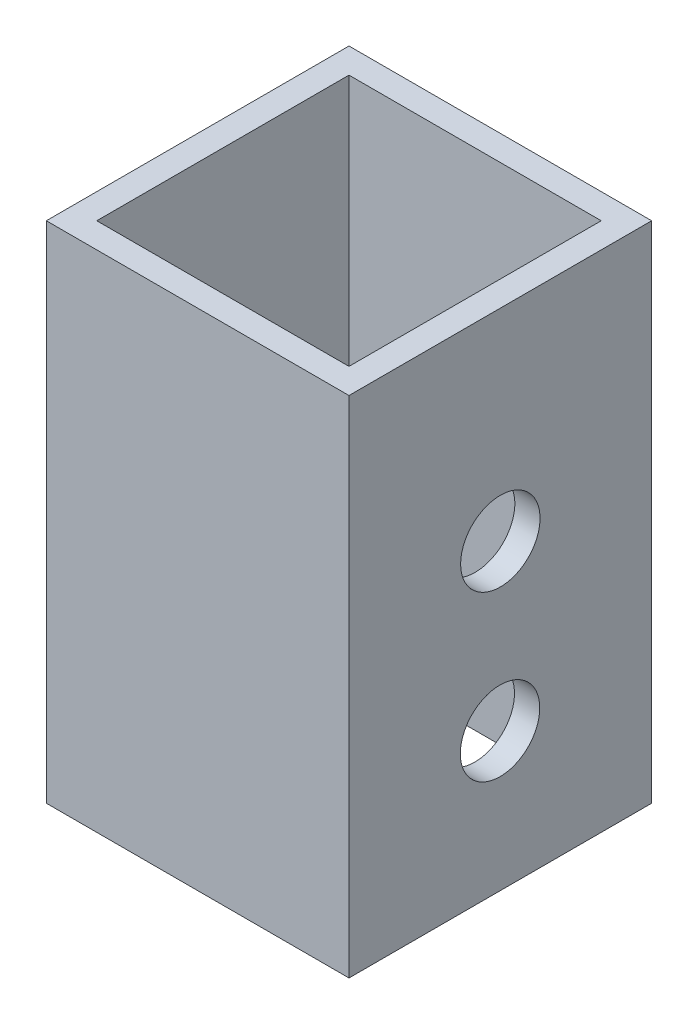
ISO-10303-21;
HEADER;
FILE_DESCRIPTION(('STEP AP214'),'2;1');
FILE_NAME('part.step','',(''),(''),'','','');
FILE_SCHEMA(('AUTOMOTIVE_DESIGN { 1 0 10303 214 1 1 1 1 }'));
ENDSEC;
DATA;
#1=APPLICATION_CONTEXT('core data for automotive mechanical design processes');
#2=APPLICATION_PROTOCOL_DEFINITION('international standard','automotive_design',2000,#1);
#3=PRODUCT_CONTEXT('',#1,'mechanical');
#4=PRODUCT('Part','Part','',(#3));
#5=PRODUCT_RELATED_PRODUCT_CATEGORY('part','',(#4));
#6=PRODUCT_DEFINITION_FORMATION('','',#4);
#7=PRODUCT_DEFINITION_CONTEXT('part definition',#1,'design');
#8=PRODUCT_DEFINITION('design','',#6,#7);
#9=PRODUCT_DEFINITION_SHAPE('','',#8);
#10=(LENGTH_UNIT() NAMED_UNIT(*) SI_UNIT(.MILLI.,.METRE.));
#11=(NAMED_UNIT(*) PLANE_ANGLE_UNIT() SI_UNIT($,.RADIAN.));
#12=(NAMED_UNIT(*) SI_UNIT($,.STERADIAN.) SOLID_ANGLE_UNIT());
#13=UNCERTAINTY_MEASURE_WITH_UNIT(LENGTH_MEASURE(1.E-05),#10,'distance_accuracy_value','');
#14=(GEOMETRIC_REPRESENTATION_CONTEXT(3) GLOBAL_UNCERTAINTY_ASSIGNED_CONTEXT((#13)) GLOBAL_UNIT_ASSIGNED_CONTEXT((#10,
#11,#12)) REPRESENTATION_CONTEXT('',''));
#15=CARTESIAN_POINT('',(0.,0.,0.));
#16=DIRECTION('',(0.,0.,1.));
#17=DIRECTION('',(1.,0.,0.));
#18=AXIS2_PLACEMENT_3D('',#15,#16,#17);
#19=CARTESIAN_POINT('',(0.,127.,0.));
#20=DIRECTION('',(0.,-1.,0.));
#21=DIRECTION('',(0.,0.,-1.));
#22=AXIS2_PLACEMENT_3D('',#19,#20,#21);
#23=PLANE('',#22);
#24=DIRECTION('',(0.,0.,-1.));
#25=VECTOR('',#24,1.);
#26=CARTESIAN_POINT('',(38.1,127.,38.1));
#27=LINE('',#26,#25);
#28=CARTESIAN_POINT('',(38.1,127.,38.1));
#29=VERTEX_POINT('',#28);
#30=CARTESIAN_POINT('',(38.1,127.,-38.1));
#31=VERTEX_POINT('',#30);
#32=EDGE_CURVE('E138',#29,#31,#27,.T.);
#33=ORIENTED_EDGE('',*,*,#32,.T.);
#34=DIRECTION('',(-1.,0.,0.));
#35=VECTOR('',#34,1.);
#36=CARTESIAN_POINT('',(-38.1,127.,-38.1));
#37=LINE('',#36,#35);
#38=CARTESIAN_POINT('',(-38.1,127.,-38.1));
#39=VERTEX_POINT('',#38);
#40=EDGE_CURVE('E141',#31,#39,#37,.T.);
#41=ORIENTED_EDGE('',*,*,#40,.T.);
#42=DIRECTION('',(0.,0.,1.));
#43=VECTOR('',#42,1.);
#44=CARTESIAN_POINT('',(-38.1,127.,38.1));
#45=LINE('',#44,#43);
#46=CARTESIAN_POINT('',(-38.1,127.,38.1));
#47=VERTEX_POINT('',#46);
#48=EDGE_CURVE('E144',#39,#47,#45,.T.);
#49=ORIENTED_EDGE('',*,*,#48,.T.);
#50=DIRECTION('',(1.,0.,0.));
#51=VECTOR('',#50,1.);
#52=CARTESIAN_POINT('',(-38.1,127.,38.1));
#53=LINE('',#52,#51);
#54=EDGE_CURVE('E146',#47,#29,#53,.T.);
#55=ORIENTED_EDGE('',*,*,#54,.T.);
#56=EDGE_LOOP('',(#33,#41,#49,#55));
#57=FACE_BOUND('',#56,.T.);
#58=DIRECTION('',(0.,0.,-1.));
#59=VECTOR('',#58,1.);
#60=CARTESIAN_POINT('',(31.75,127.,31.75));
#61=LINE('',#60,#59);
#62=CARTESIAN_POINT('',(31.75,127.,31.75));
#63=VERTEX_POINT('',#62);
#64=CARTESIAN_POINT('',(31.75,127.,-31.75));
#65=VERTEX_POINT('',#64);
#66=EDGE_CURVE('E100',#63,#65,#61,.T.);
#67=ORIENTED_EDGE('',*,*,#66,.F.);
#68=DIRECTION('',(1.,0.,0.));
#69=VECTOR('',#68,1.);
#70=CARTESIAN_POINT('',(-31.75,127.,31.75));
#71=LINE('',#70,#69);
#72=CARTESIAN_POINT('',(-31.75,127.,31.75));
#73=VERTEX_POINT('',#72);
#74=EDGE_CURVE('E122',#73,#63,#71,.T.);
#75=ORIENTED_EDGE('',*,*,#74,.F.);
#76=DIRECTION('',(0.,0.,1.));
#77=VECTOR('',#76,1.);
#78=CARTESIAN_POINT('',(-31.75,127.,31.75));
#79=LINE('',#78,#77);
#80=CARTESIAN_POINT('',(-31.75,127.,-31.75));
#81=VERTEX_POINT('',#80);
#82=EDGE_CURVE('E120',#81,#73,#79,.T.);
#83=ORIENTED_EDGE('',*,*,#82,.F.);
#84=DIRECTION('',(-1.,0.,0.));
#85=VECTOR('',#84,1.);
#86=CARTESIAN_POINT('',(-31.75,127.,-31.75));
#87=LINE('',#86,#85);
#88=EDGE_CURVE('E108',#65,#81,#87,.T.);
#89=ORIENTED_EDGE('',*,*,#88,.F.);
#90=EDGE_LOOP('',(#67,#75,#83,#89));
#91=FACE_BOUND('',#90,.T.);
#92=ADVANCED_FACE('F33',(#57,#91),#23,.F.);
#93=CARTESIAN_POINT('',(0.,0.,0.));
#94=DIRECTION('',(0.,-1.,0.));
#95=DIRECTION('',(0.,0.,-1.));
#96=AXIS2_PLACEMENT_3D('',#93,#94,#95);
#97=PLANE('',#96);
#98=DIRECTION('',(0.,0.,-1.));
#99=VECTOR('',#98,1.);
#100=CARTESIAN_POINT('',(38.1,0.,38.1));
#101=LINE('',#100,#99);
#102=CARTESIAN_POINT('',(38.1,0.,38.1));
#103=VERTEX_POINT('',#102);
#104=CARTESIAN_POINT('',(38.1,0.,-38.1));
#105=VERTEX_POINT('',#104);
#106=EDGE_CURVE('E116',#103,#105,#101,.T.);
#107=ORIENTED_EDGE('',*,*,#106,.F.);
#108=DIRECTION('',(1.,0.,0.));
#109=VECTOR('',#108,1.);
#110=CARTESIAN_POINT('',(-38.1,0.,38.1));
#111=LINE('',#110,#109);
#112=CARTESIAN_POINT('',(-38.1,0.,38.1));
#113=VERTEX_POINT('',#112);
#114=EDGE_CURVE('E142',#113,#103,#111,.T.);
#115=ORIENTED_EDGE('',*,*,#114,.F.);
#116=DIRECTION('',(0.,0.,1.));
#117=VECTOR('',#116,1.);
#118=CARTESIAN_POINT('',(-38.1,0.,38.1));
#119=LINE('',#118,#117);
#120=CARTESIAN_POINT('',(-38.1,0.,-38.1));
#121=VERTEX_POINT('',#120);
#122=EDGE_CURVE('E153',#121,#113,#119,.T.);
#123=ORIENTED_EDGE('',*,*,#122,.F.);
#124=DIRECTION('',(-1.,0.,0.));
#125=VECTOR('',#124,1.);
#126=CARTESIAN_POINT('',(-38.1,0.,-38.1));
#127=LINE('',#126,#125);
#128=EDGE_CURVE('E151',#105,#121,#127,.T.);
#129=ORIENTED_EDGE('',*,*,#128,.F.);
#130=EDGE_LOOP('',(#107,#115,#123,#129));
#131=FACE_BOUND('',#130,.T.);
#132=DIRECTION('',(1.,0.,0.));
#133=VECTOR('',#132,1.);
#134=CARTESIAN_POINT('',(-31.75,0.,31.75));
#135=LINE('',#134,#133);
#136=CARTESIAN_POINT('',(-31.75,0.,31.75));
#137=VERTEX_POINT('',#136);
#138=CARTESIAN_POINT('',(31.75,0.,31.75));
#139=VERTEX_POINT('',#138);
#140=EDGE_CURVE('E109',#137,#139,#135,.T.);
#141=ORIENTED_EDGE('',*,*,#140,.T.);
#142=DIRECTION('',(0.,0.,-1.));
#143=VECTOR('',#142,1.);
#144=CARTESIAN_POINT('',(31.75,0.,31.75));
#145=LINE('',#144,#143);
#146=CARTESIAN_POINT('',(31.75,0.,-31.75));
#147=VERTEX_POINT('',#146);
#148=EDGE_CURVE('E58',#139,#147,#145,.T.);
#149=ORIENTED_EDGE('',*,*,#148,.T.);
#150=DIRECTION('',(-1.,0.,0.));
#151=VECTOR('',#150,1.);
#152=CARTESIAN_POINT('',(-31.75,0.,-31.75));
#153=LINE('',#152,#151);
#154=CARTESIAN_POINT('',(-31.75,0.,-31.75));
#155=VERTEX_POINT('',#154);
#156=EDGE_CURVE('E115',#147,#155,#153,.T.);
#157=ORIENTED_EDGE('',*,*,#156,.T.);
#158=DIRECTION('',(0.,0.,1.));
#159=VECTOR('',#158,1.);
#160=CARTESIAN_POINT('',(-31.75,0.,31.75));
#161=LINE('',#160,#159);
#162=EDGE_CURVE('E130',#155,#137,#161,.T.);
#163=ORIENTED_EDGE('',*,*,#162,.T.);
#164=EDGE_LOOP('',(#141,#149,#157,#163));
#165=FACE_BOUND('',#164,.T.);
#166=ADVANCED_FACE('F232',(#131,#165),#97,.T.);
#167=CARTESIAN_POINT('',(38.1,127.,38.1));
#168=DIRECTION('',(-1.,0.,0.));
#169=DIRECTION('',(0.,0.,1.));
#170=AXIS2_PLACEMENT_3D('',#167,#168,#169);
#171=PLANE('',#170);
#172=CARTESIAN_POINT('',(38.1,76.2,0.));
#173=DIRECTION('',(-1.,0.,0.));
#174=DIRECTION('',(0.,0.,1.));
#175=AXIS2_PLACEMENT_3D('',#172,#173,#174);
#176=CIRCLE('',#175,10.);
#177=CARTESIAN_POINT('',(38.1,76.2,10.));
#178=VERTEX_POINT('',#177);
#179=EDGE_CURVE('E315',#178,#178,#176,.T.);
#180=ORIENTED_EDGE('',*,*,#179,.T.);
#181=EDGE_LOOP('',(#180));
#182=FACE_BOUND('',#181,.T.);
#183=CARTESIAN_POINT('',(38.1,34.8835255460422,0.0801285233119672));
#184=DIRECTION('',(-1.,0.,0.));
#185=DIRECTION('',(0.,0.,1.));
#186=AXIS2_PLACEMENT_3D('',#183,#184,#185);
#187=CIRCLE('',#186,10.);
#188=CARTESIAN_POINT('',(38.1,34.8835255460422,10.080128523312));
#189=VERTEX_POINT('',#188);
#190=EDGE_CURVE('E165',#189,#189,#187,.T.);
#191=ORIENTED_EDGE('',*,*,#190,.T.);
#192=EDGE_LOOP('',(#191));
#193=FACE_BOUND('',#192,.T.);
#194=ORIENTED_EDGE('',*,*,#106,.T.);
#195=DIRECTION('',(0.,-1.,0.));
#196=VECTOR('',#195,1.);
#197=CARTESIAN_POINT('',(38.1,127.,-38.1));
#198=LINE('',#197,#196);
#199=EDGE_CURVE('E11',#31,#105,#198,.T.);
#200=ORIENTED_EDGE('',*,*,#199,.F.);
#201=ORIENTED_EDGE('',*,*,#32,.F.);
#202=DIRECTION('',(0.,-1.,0.));
#203=VECTOR('',#202,1.);
#204=CARTESIAN_POINT('',(38.1,127.,38.1));
#205=LINE('',#204,#203);
#206=EDGE_CURVE('E148',#29,#103,#205,.T.);
#207=ORIENTED_EDGE('',*,*,#206,.T.);
#208=EDGE_LOOP('',(#194,#200,#201,#207));
#209=FACE_BOUND('',#208,.T.);
#210=ADVANCED_FACE('F35',(#182,#193,#209),#171,.F.);
#211=CARTESIAN_POINT('',(-38.1,127.,-38.1));
#212=DIRECTION('',(0.,0.,1.));
#213=DIRECTION('',(1.,0.,0.));
#214=AXIS2_PLACEMENT_3D('',#211,#212,#213);
#215=PLANE('',#214);
#216=ORIENTED_EDGE('',*,*,#128,.T.);
#217=DIRECTION('',(0.,-1.,0.));
#218=VECTOR('',#217,1.);
#219=CARTESIAN_POINT('',(-38.1,127.,-38.1));
#220=LINE('',#219,#218);
#221=EDGE_CURVE('E42',#39,#121,#220,.T.);
#222=ORIENTED_EDGE('',*,*,#221,.F.);
#223=ORIENTED_EDGE('',*,*,#40,.F.);
#224=ORIENTED_EDGE('',*,*,#199,.T.);
#225=EDGE_LOOP('',(#216,#222,#223,#224));
#226=FACE_BOUND('',#225,.T.);
#227=ADVANCED_FACE('F219',(#226),#215,.F.);
#228=CARTESIAN_POINT('',(-38.1,127.,38.1));
#229=DIRECTION('',(1.,0.,0.));
#230=DIRECTION('',(0.,0.,-1.));
#231=AXIS2_PLACEMENT_3D('',#228,#229,#230);
#232=PLANE('',#231);
#233=CARTESIAN_POINT('',(-38.1,76.2,0.));
#234=DIRECTION('',(-1.,0.,0.));
#235=DIRECTION('',(0.,0.,1.));
#236=AXIS2_PLACEMENT_3D('',#233,#234,#235);
#237=CIRCLE('',#236,10.);
#238=CARTESIAN_POINT('',(-38.1,76.2,10.));
#239=VERTEX_POINT('',#238);
#240=EDGE_CURVE('E317',#239,#239,#237,.T.);
#241=ORIENTED_EDGE('',*,*,#240,.F.);
#242=EDGE_LOOP('',(#241));
#243=FACE_BOUND('',#242,.T.);
#244=CARTESIAN_POINT('',(-38.1,34.8835255460422,0.0801285233119672));
#245=DIRECTION('',(-1.,0.,0.));
#246=DIRECTION('',(0.,0.,1.));
#247=AXIS2_PLACEMENT_3D('',#244,#245,#246);
#248=CIRCLE('',#247,10.);
#249=CARTESIAN_POINT('',(-38.1,34.8835255460422,10.080128523312));
#250=VERTEX_POINT('',#249);
#251=EDGE_CURVE('E172',#250,#250,#248,.T.);
#252=ORIENTED_EDGE('',*,*,#251,.F.);
#253=EDGE_LOOP('',(#252));
#254=FACE_BOUND('',#253,.T.);
#255=CARTESIAN_POINT('',(-38.1,58.4566978638487,23.6533008411185));
#256=DIRECTION('',(-1.,0.,0.));
#257=DIRECTION('',(0.,0.,1.));
#258=AXIS2_PLACEMENT_3D('',#255,#256,#257);
#259=CIRCLE('',#258,2.4765);
#260=CARTESIAN_POINT('',(-38.1,58.4566978638487,26.1298008411185));
#261=VERTEX_POINT('',#260);
#262=EDGE_CURVE('E169',#261,#261,#259,.T.);
#263=ORIENTED_EDGE('',*,*,#262,.F.);
#264=EDGE_LOOP('',(#263));
#265=FACE_BOUND('',#264,.T.);
#266=CARTESIAN_POINT('',(-38.1,11.3103532282356,23.6533008411185));
#267=DIRECTION('',(-1.,0.,0.));
#268=DIRECTION('',(0.,0.,1.));
#269=AXIS2_PLACEMENT_3D('',#266,#267,#268);
#270=CIRCLE('',#269,2.4765);
#271=CARTESIAN_POINT('',(-38.1,11.3103532282356,26.1298008411185));
#272=VERTEX_POINT('',#271);
#273=EDGE_CURVE('E192',#272,#272,#270,.T.);
#274=ORIENTED_EDGE('',*,*,#273,.F.);
#275=EDGE_LOOP('',(#274));
#276=FACE_BOUND('',#275,.T.);
#277=CARTESIAN_POINT('',(-38.1,11.3103532282356,-23.4930437944946));
#278=DIRECTION('',(-1.,0.,0.));
#279=DIRECTION('',(0.,0.,1.));
#280=AXIS2_PLACEMENT_3D('',#277,#278,#279);
#281=CIRCLE('',#280,2.4765);
#282=CARTESIAN_POINT('',(-38.1,11.3103532282356,-21.0165437944946));
#283=VERTEX_POINT('',#282);
#284=EDGE_CURVE('E186',#283,#283,#281,.T.);
#285=ORIENTED_EDGE('',*,*,#284,.F.);
#286=EDGE_LOOP('',(#285));
#287=FACE_BOUND('',#286,.T.);
#288=CARTESIAN_POINT('',(-38.1,58.4566978638487,-23.4930437944946));
#289=DIRECTION('',(-1.,0.,0.));
#290=DIRECTION('',(0.,0.,1.));
#291=AXIS2_PLACEMENT_3D('',#288,#289,#290);
#292=CIRCLE('',#291,2.47649999999999);
#293=CARTESIAN_POINT('',(-38.1,58.4566978638487,-21.0165437944946));
#294=VERTEX_POINT('',#293);
#295=EDGE_CURVE('E128',#294,#294,#292,.T.);
#296=ORIENTED_EDGE('',*,*,#295,.F.);
#297=EDGE_LOOP('',(#296));
#298=FACE_BOUND('',#297,.T.);
#299=ORIENTED_EDGE('',*,*,#122,.T.);
#300=DIRECTION('',(0.,-1.,0.));
#301=VECTOR('',#300,1.);
#302=CARTESIAN_POINT('',(-38.1,127.,38.1));
#303=LINE('',#302,#301);
#304=EDGE_CURVE('E158',#47,#113,#303,.T.);
#305=ORIENTED_EDGE('',*,*,#304,.F.);
#306=ORIENTED_EDGE('',*,*,#48,.F.);
#307=ORIENTED_EDGE('',*,*,#221,.T.);
#308=EDGE_LOOP('',(#299,#305,#306,#307));
#309=FACE_BOUND('',#308,.T.);
#310=ADVANCED_FACE('F215',(#243,#254,#265,#276,#287,#298,#309),#232,.F.);
#311=CARTESIAN_POINT('',(-38.1,127.,38.1));
#312=DIRECTION('',(0.,0.,-1.));
#313=DIRECTION('',(-1.,0.,0.));
#314=AXIS2_PLACEMENT_3D('',#311,#312,#313);
#315=PLANE('',#314);
#316=ORIENTED_EDGE('',*,*,#114,.T.);
#317=ORIENTED_EDGE('',*,*,#206,.F.);
#318=ORIENTED_EDGE('',*,*,#54,.F.);
#319=ORIENTED_EDGE('',*,*,#304,.T.);
#320=EDGE_LOOP('',(#316,#317,#318,#319));
#321=FACE_BOUND('',#320,.T.);
#322=ADVANCED_FACE('F218',(#321),#315,.F.);
#323=CARTESIAN_POINT('',(31.75,127.,31.75));
#324=DIRECTION('',(-1.,0.,0.));
#325=DIRECTION('',(0.,0.,1.));
#326=AXIS2_PLACEMENT_3D('',#323,#324,#325);
#327=PLANE('',#326);
#328=CARTESIAN_POINT('',(31.75,76.2,0.));
#329=DIRECTION('',(-1.,0.,0.));
#330=DIRECTION('',(0.,0.,1.));
#331=AXIS2_PLACEMENT_3D('',#328,#329,#330);
#332=CIRCLE('',#331,10.);
#333=CARTESIAN_POINT('',(31.75,76.2,10.));
#334=VERTEX_POINT('',#333);
#335=EDGE_CURVE('E177',#334,#334,#332,.T.);
#336=ORIENTED_EDGE('',*,*,#335,.F.);
#337=EDGE_LOOP('',(#336));
#338=FACE_BOUND('',#337,.T.);
#339=CARTESIAN_POINT('',(31.75,34.8835255460422,0.0801285233119672));
#340=DIRECTION('',(-1.,0.,0.));
#341=DIRECTION('',(0.,0.,1.));
#342=AXIS2_PLACEMENT_3D('',#339,#340,#341);
#343=CIRCLE('',#342,10.);
#344=CARTESIAN_POINT('',(31.75,34.8835255460422,10.080128523312));
#345=VERTEX_POINT('',#344);
#346=EDGE_CURVE('E164',#345,#345,#343,.T.);
#347=ORIENTED_EDGE('',*,*,#346,.F.);
#348=EDGE_LOOP('',(#347));
#349=FACE_BOUND('',#348,.T.);
#350=ORIENTED_EDGE('',*,*,#148,.F.);
#351=DIRECTION('',(0.,-1.,0.));
#352=VECTOR('',#351,1.);
#353=CARTESIAN_POINT('',(31.75,127.,31.75));
#354=LINE('',#353,#352);
#355=EDGE_CURVE('E104',#63,#139,#354,.T.);
#356=ORIENTED_EDGE('',*,*,#355,.F.);
#357=ORIENTED_EDGE('',*,*,#66,.T.);
#358=DIRECTION('',(0.,-1.,0.));
#359=VECTOR('',#358,1.);
#360=CARTESIAN_POINT('',(31.75,127.,-31.75));
#361=LINE('',#360,#359);
#362=EDGE_CURVE('E103',#65,#147,#361,.T.);
#363=ORIENTED_EDGE('',*,*,#362,.T.);
#364=EDGE_LOOP('',(#350,#356,#357,#363));
#365=FACE_BOUND('',#364,.T.);
#366=ADVANCED_FACE('F102',(#338,#349,#365),#327,.T.);
#367=CARTESIAN_POINT('',(-31.75,127.,-31.75));
#368=DIRECTION('',(0.,0.,1.));
#369=DIRECTION('',(1.,0.,0.));
#370=AXIS2_PLACEMENT_3D('',#367,#368,#369);
#371=PLANE('',#370);
#372=ORIENTED_EDGE('',*,*,#156,.F.);
#373=ORIENTED_EDGE('',*,*,#362,.F.);
#374=ORIENTED_EDGE('',*,*,#88,.T.);
#375=DIRECTION('',(0.,-1.,0.));
#376=VECTOR('',#375,1.);
#377=CARTESIAN_POINT('',(-31.75,127.,-31.75));
#378=LINE('',#377,#376);
#379=EDGE_CURVE('E117',#81,#155,#378,.T.);
#380=ORIENTED_EDGE('',*,*,#379,.T.);
#381=EDGE_LOOP('',(#372,#373,#374,#380));
#382=FACE_BOUND('',#381,.T.);
#383=ADVANCED_FACE('F112',(#382),#371,.T.);
#384=CARTESIAN_POINT('',(-31.75,127.,31.75));
#385=DIRECTION('',(1.,0.,0.));
#386=DIRECTION('',(0.,0.,-1.));
#387=AXIS2_PLACEMENT_3D('',#384,#385,#386);
#388=PLANE('',#387);
#389=CARTESIAN_POINT('',(-31.75,76.2,0.));
#390=DIRECTION('',(1.,0.,0.));
#391=DIRECTION('',(0.,0.,-1.));
#392=AXIS2_PLACEMENT_3D('',#389,#390,#391);
#393=CIRCLE('',#392,10.);
#394=CARTESIAN_POINT('',(-31.75,76.2,-10.));
#395=VERTEX_POINT('',#394);
#396=EDGE_CURVE('E37',#395,#395,#393,.T.);
#397=ORIENTED_EDGE('',*,*,#396,.F.);
#398=EDGE_LOOP('',(#397));
#399=FACE_BOUND('',#398,.T.);
#400=CARTESIAN_POINT('',(-31.75,34.8835255460422,0.0801285233119672));
#401=DIRECTION('',(1.,0.,0.));
#402=DIRECTION('',(0.,0.,-1.));
#403=AXIS2_PLACEMENT_3D('',#400,#401,#402);
#404=CIRCLE('',#403,10.);
#405=CARTESIAN_POINT('',(-31.75,34.8835255460422,-9.91987147668804));
#406=VERTEX_POINT('',#405);
#407=EDGE_CURVE('E162',#406,#406,#404,.T.);
#408=ORIENTED_EDGE('',*,*,#407,.F.);
#409=EDGE_LOOP('',(#408));
#410=FACE_BOUND('',#409,.T.);
#411=CARTESIAN_POINT('',(-31.75,58.4566978638487,23.6533008411185));
#412=DIRECTION('',(1.,0.,0.));
#413=DIRECTION('',(0.,0.,-1.));
#414=AXIS2_PLACEMENT_3D('',#411,#412,#413);
#415=CIRCLE('',#414,2.4765);
#416=CARTESIAN_POINT('',(-31.75,58.4566978638487,21.1768008411185));
#417=VERTEX_POINT('',#416);
#418=EDGE_CURVE('E195',#417,#417,#415,.F.);
#419=ORIENTED_EDGE('',*,*,#418,.T.);
#420=EDGE_LOOP('',(#419));
#421=FACE_BOUND('',#420,.T.);
#422=CARTESIAN_POINT('',(-31.75,11.3103532282356,23.6533008411185));
#423=DIRECTION('',(1.,0.,0.));
#424=DIRECTION('',(0.,0.,-1.));
#425=AXIS2_PLACEMENT_3D('',#422,#423,#424);
#426=CIRCLE('',#425,2.4765);
#427=CARTESIAN_POINT('',(-31.75,11.3103532282356,21.1768008411185));
#428=VERTEX_POINT('',#427);
#429=EDGE_CURVE('E189',#428,#428,#426,.F.);
#430=ORIENTED_EDGE('',*,*,#429,.T.);
#431=EDGE_LOOP('',(#430));
#432=FACE_BOUND('',#431,.T.);
#433=CARTESIAN_POINT('',(-31.75,11.3103532282356,-23.4930437944946));
#434=DIRECTION('',(1.,0.,0.));
#435=DIRECTION('',(0.,0.,-1.));
#436=AXIS2_PLACEMENT_3D('',#433,#434,#435);
#437=CIRCLE('',#436,2.4765);
#438=CARTESIAN_POINT('',(-31.75,11.3103532282356,-25.9695437944946));
#439=VERTEX_POINT('',#438);
#440=EDGE_CURVE('E182',#439,#439,#437,.F.);
#441=ORIENTED_EDGE('',*,*,#440,.T.);
#442=EDGE_LOOP('',(#441));
#443=FACE_BOUND('',#442,.T.);
#444=CARTESIAN_POINT('',(-31.75,58.4566978638487,-23.4930437944946));
#445=DIRECTION('',(1.,0.,0.));
#446=DIRECTION('',(0.,0.,-1.));
#447=AXIS2_PLACEMENT_3D('',#444,#445,#446);
#448=CIRCLE('',#447,2.47649999999999);
#449=CARTESIAN_POINT('',(-31.75,58.4566978638487,-25.9695437944946));
#450=VERTEX_POINT('',#449);
#451=EDGE_CURVE('E185',#450,#450,#448,.F.);
#452=ORIENTED_EDGE('',*,*,#451,.T.);
#453=EDGE_LOOP('',(#452));
#454=FACE_BOUND('',#453,.T.);
#455=ORIENTED_EDGE('',*,*,#162,.F.);
#456=ORIENTED_EDGE('',*,*,#379,.F.);
#457=ORIENTED_EDGE('',*,*,#82,.T.);
#458=DIRECTION('',(0.,-1.,0.));
#459=VECTOR('',#458,1.);
#460=CARTESIAN_POINT('',(-31.75,127.,31.75));
#461=LINE('',#460,#459);
#462=EDGE_CURVE('E50',#73,#137,#461,.T.);
#463=ORIENTED_EDGE('',*,*,#462,.T.);
#464=EDGE_LOOP('',(#455,#456,#457,#463));
#465=FACE_BOUND('',#464,.T.);
#466=ADVANCED_FACE('F204',(#399,#410,#421,#432,#443,#454,#465),#388,.T.);
#467=CARTESIAN_POINT('',(-31.75,127.,31.75));
#468=DIRECTION('',(0.,0.,-1.));
#469=DIRECTION('',(-1.,0.,0.));
#470=AXIS2_PLACEMENT_3D('',#467,#468,#469);
#471=PLANE('',#470);
#472=ORIENTED_EDGE('',*,*,#140,.F.);
#473=ORIENTED_EDGE('',*,*,#462,.F.);
#474=ORIENTED_EDGE('',*,*,#74,.T.);
#475=ORIENTED_EDGE('',*,*,#355,.T.);
#476=EDGE_LOOP('',(#472,#473,#474,#475));
#477=FACE_BOUND('',#476,.T.);
#478=ADVANCED_FACE('F211',(#477),#471,.T.);
#479=CARTESIAN_POINT('',(38.101,58.4566978638487,-23.4930437944946));
#480=DIRECTION('',(-1.,0.,0.));
#481=DIRECTION('',(0.,0.,1.));
#482=AXIS2_PLACEMENT_3D('',#479,#480,#481);
#483=CYLINDRICAL_SURFACE('',#482,2.47649999999999);
#484=ORIENTED_EDGE('',*,*,#451,.F.);
#485=EDGE_LOOP('',(#484));
#486=FACE_BOUND('',#485,.T.);
#487=ORIENTED_EDGE('',*,*,#295,.T.);
#488=EDGE_LOOP('',(#487));
#489=FACE_BOUND('',#488,.T.);
#490=ADVANCED_FACE('F207',(#486,#489),#483,.F.);
#491=CARTESIAN_POINT('',(38.101,11.3103532282356,-23.4930437944946));
#492=DIRECTION('',(-1.,0.,0.));
#493=DIRECTION('',(0.,0.,1.));
#494=AXIS2_PLACEMENT_3D('',#491,#492,#493);
#495=CYLINDRICAL_SURFACE('',#494,2.4765);
#496=ORIENTED_EDGE('',*,*,#440,.F.);
#497=EDGE_LOOP('',(#496));
#498=FACE_BOUND('',#497,.T.);
#499=ORIENTED_EDGE('',*,*,#284,.T.);
#500=EDGE_LOOP('',(#499));
#501=FACE_BOUND('',#500,.T.);
#502=ADVANCED_FACE('F210',(#498,#501),#495,.F.);
#503=CARTESIAN_POINT('',(38.101,11.3103532282356,23.6533008411185));
#504=DIRECTION('',(-1.,0.,0.));
#505=DIRECTION('',(0.,0.,1.));
#506=AXIS2_PLACEMENT_3D('',#503,#504,#505);
#507=CYLINDRICAL_SURFACE('',#506,2.4765);
#508=ORIENTED_EDGE('',*,*,#429,.F.);
#509=EDGE_LOOP('',(#508));
#510=FACE_BOUND('',#509,.T.);
#511=ORIENTED_EDGE('',*,*,#273,.T.);
#512=EDGE_LOOP('',(#511));
#513=FACE_BOUND('',#512,.T.);
#514=ADVANCED_FACE('F283',(#510,#513),#507,.F.);
#515=CARTESIAN_POINT('',(38.101,58.4566978638487,23.6533008411185));
#516=DIRECTION('',(-1.,0.,0.));
#517=DIRECTION('',(0.,0.,1.));
#518=AXIS2_PLACEMENT_3D('',#515,#516,#517);
#519=CYLINDRICAL_SURFACE('',#518,2.4765);
#520=ORIENTED_EDGE('',*,*,#418,.F.);
#521=EDGE_LOOP('',(#520));
#522=FACE_BOUND('',#521,.T.);
#523=ORIENTED_EDGE('',*,*,#262,.T.);
#524=EDGE_LOOP('',(#523));
#525=FACE_BOUND('',#524,.T.);
#526=ADVANCED_FACE('F279',(#522,#525),#519,.F.);
#527=CARTESIAN_POINT('',(38.1,34.8835255460422,0.0801285233119672));
#528=DIRECTION('',(-1.,0.,0.));
#529=DIRECTION('',(0.,0.,1.));
#530=AXIS2_PLACEMENT_3D('',#527,#528,#529);
#531=CYLINDRICAL_SURFACE('',#530,10.);
#532=ORIENTED_EDGE('',*,*,#407,.T.);
#533=EDGE_LOOP('',(#532));
#534=FACE_BOUND('',#533,.T.);
#535=ORIENTED_EDGE('',*,*,#251,.T.);
#536=EDGE_LOOP('',(#535));
#537=FACE_BOUND('',#536,.T.);
#538=ADVANCED_FACE('F270',(#534,#537),#531,.F.);
#539=ORIENTED_EDGE('',*,*,#346,.T.);
#540=EDGE_LOOP('',(#539));
#541=FACE_BOUND('',#540,.T.);
#542=ORIENTED_EDGE('',*,*,#190,.F.);
#543=EDGE_LOOP('',(#542));
#544=FACE_BOUND('',#543,.T.);
#545=ADVANCED_FACE('F266',(#541,#544),#531,.F.);
#546=CARTESIAN_POINT('',(38.1,76.2,0.));
#547=DIRECTION('',(-1.,0.,0.));
#548=DIRECTION('',(0.,0.,1.));
#549=AXIS2_PLACEMENT_3D('',#546,#547,#548);
#550=CYLINDRICAL_SURFACE('',#549,10.);
#551=ORIENTED_EDGE('',*,*,#396,.T.);
#552=EDGE_LOOP('',(#551));
#553=FACE_BOUND('',#552,.T.);
#554=ORIENTED_EDGE('',*,*,#240,.T.);
#555=EDGE_LOOP('',(#554));
#556=FACE_BOUND('',#555,.T.);
#557=ADVANCED_FACE('F269',(#553,#556),#550,.F.);
#558=ORIENTED_EDGE('',*,*,#335,.T.);
#559=EDGE_LOOP('',(#558));
#560=FACE_BOUND('',#559,.T.);
#561=ORIENTED_EDGE('',*,*,#179,.F.);
#562=EDGE_LOOP('',(#561));
#563=FACE_BOUND('',#562,.T.);
#564=ADVANCED_FACE('F276',(#560,#563),#550,.F.);
#565=CLOSED_SHELL('',(#92,#166,#210,#227,#310,#322,#366,#383,#466,#478,#490,#502,#514,#526,#538,
#545,#557,#564));
#566=MANIFOLD_SOLID_BREP('B2',#565);
#567=ADVANCED_BREP_SHAPE_REPRESENTATION('',(#18,#566),#14);
#568=SHAPE_DEFINITION_REPRESENTATION(#9,#567);
ENDSEC;
END-ISO-10303-21;
